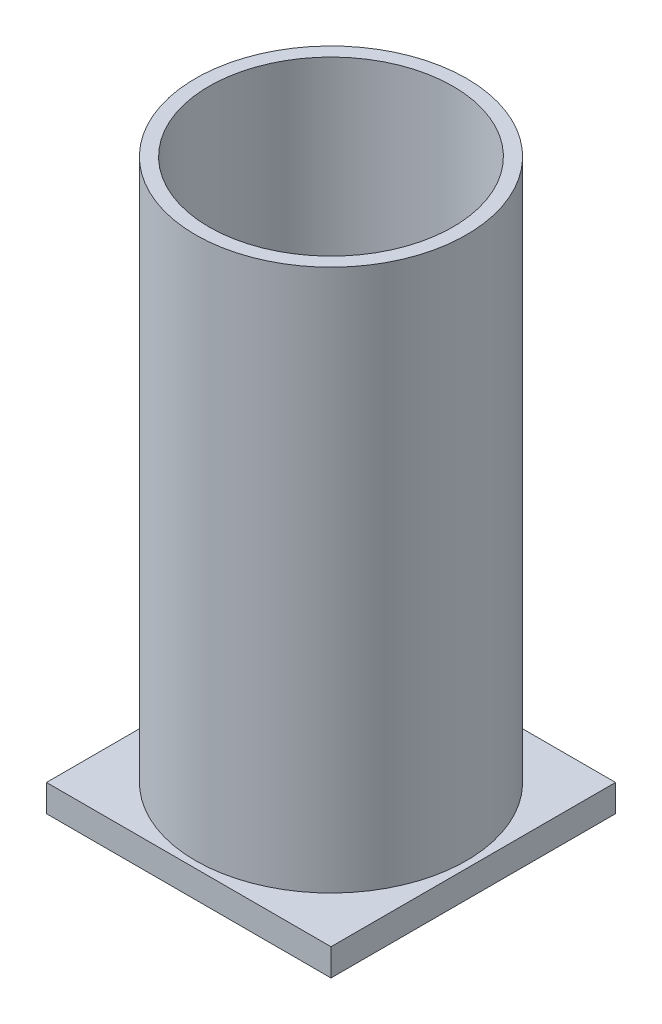
ISO-10303-21;
HEADER;
FILE_DESCRIPTION(('STEP AP214'),'2;1');
FILE_NAME('part.step','',(''),(''),'','','');
FILE_SCHEMA(('AUTOMOTIVE_DESIGN { 1 0 10303 214 1 1 1 1 }'));
ENDSEC;
DATA;
#1=APPLICATION_CONTEXT('core data for automotive mechanical design processes');
#2=APPLICATION_PROTOCOL_DEFINITION('international standard','automotive_design',2000,#1);
#3=PRODUCT_CONTEXT('',#1,'mechanical');
#4=PRODUCT('Part','Part','',(#3));
#5=PRODUCT_RELATED_PRODUCT_CATEGORY('part','',(#4));
#6=PRODUCT_DEFINITION_FORMATION('','',#4);
#7=PRODUCT_DEFINITION_CONTEXT('part definition',#1,'design');
#8=PRODUCT_DEFINITION('design','',#6,#7);
#9=PRODUCT_DEFINITION_SHAPE('','',#8);
#10=(LENGTH_UNIT() NAMED_UNIT(*) SI_UNIT(.MILLI.,.METRE.));
#11=(NAMED_UNIT(*) PLANE_ANGLE_UNIT() SI_UNIT($,.RADIAN.));
#12=(NAMED_UNIT(*) SI_UNIT($,.STERADIAN.) SOLID_ANGLE_UNIT());
#13=UNCERTAINTY_MEASURE_WITH_UNIT(LENGTH_MEASURE(1.E-05),#10,'distance_accuracy_value','');
#14=(GEOMETRIC_REPRESENTATION_CONTEXT(3) GLOBAL_UNCERTAINTY_ASSIGNED_CONTEXT((#13)) GLOBAL_UNIT_ASSIGNED_CONTEXT((#10,
#11,#12)) REPRESENTATION_CONTEXT('',''));
#15=CARTESIAN_POINT('',(0.,0.,0.));
#16=DIRECTION('',(0.,0.,1.));
#17=DIRECTION('',(1.,0.,0.));
#18=AXIS2_PLACEMENT_3D('',#15,#16,#17);
#19=CARTESIAN_POINT('',(0.,200.,0.));
#20=DIRECTION('',(0.,1.,0.));
#21=DIRECTION('',(0.,0.,1.));
#22=AXIS2_PLACEMENT_3D('',#19,#20,#21);
#23=PLANE('',#22);
#24=CARTESIAN_POINT('',(0.,200.,0.));
#25=DIRECTION('',(0.,1.,0.));
#26=DIRECTION('',(0.,0.,1.));
#27=AXIS2_PLACEMENT_3D('',#24,#25,#26);
#28=CIRCLE('',#27,50.);
#29=CARTESIAN_POINT('',(0.,200.,50.));
#30=VERTEX_POINT('',#29);
#31=EDGE_CURVE('E11',#30,#30,#28,.T.);
#32=ORIENTED_EDGE('',*,*,#31,.T.);
#33=EDGE_LOOP('',(#32));
#34=FACE_BOUND('',#33,.T.);
#35=CARTESIAN_POINT('',(0.,200.,0.));
#36=DIRECTION('',(0.,1.,0.));
#37=DIRECTION('',(0.,0.,1.));
#38=AXIS2_PLACEMENT_3D('',#35,#36,#37);
#39=CIRCLE('',#38,45.);
#40=CARTESIAN_POINT('',(0.,200.,45.));
#41=VERTEX_POINT('',#40);
#42=EDGE_CURVE('E43',#41,#41,#39,.T.);
#43=ORIENTED_EDGE('',*,*,#42,.F.);
#44=EDGE_LOOP('',(#43));
#45=FACE_BOUND('',#44,.T.);
#46=ADVANCED_FACE('F33',(#34,#45),#23,.T.);
#47=CARTESIAN_POINT('',(0.,200.,0.));
#48=DIRECTION('',(0.,-1.,0.));
#49=DIRECTION('',(0.,0.,-1.));
#50=AXIS2_PLACEMENT_3D('',#47,#48,#49);
#51=CYLINDRICAL_SURFACE('',#50,50.);
#52=ORIENTED_EDGE('',*,*,#31,.F.);
#53=EDGE_LOOP('',(#52));
#54=FACE_BOUND('',#53,.T.);
#55=CARTESIAN_POINT('',(0.,0.,0.));
#56=DIRECTION('',(0.,1.,0.));
#57=DIRECTION('',(0.,0.,1.));
#58=AXIS2_PLACEMENT_3D('',#55,#56,#57);
#59=CIRCLE('',#58,50.);
#60=CARTESIAN_POINT('',(0.,0.,50.));
#61=VERTEX_POINT('',#60);
#62=EDGE_CURVE('E37',#61,#61,#59,.T.);
#63=ORIENTED_EDGE('',*,*,#62,.T.);
#64=EDGE_LOOP('',(#63));
#65=FACE_BOUND('',#64,.T.);
#66=ADVANCED_FACE('F35',(#54,#65),#51,.T.);
#67=CARTESIAN_POINT('',(0.,200.,0.));
#68=DIRECTION('',(0.,-1.,0.));
#69=DIRECTION('',(0.,0.,-1.));
#70=AXIS2_PLACEMENT_3D('',#67,#68,#69);
#71=CYLINDRICAL_SURFACE('',#70,45.);
#72=ORIENTED_EDGE('',*,*,#42,.T.);
#73=EDGE_LOOP('',(#72));
#74=FACE_BOUND('',#73,.T.);
#75=CARTESIAN_POINT('',(0.,0.,0.));
#76=DIRECTION('',(0.,1.,0.));
#77=DIRECTION('',(0.,0.,1.));
#78=AXIS2_PLACEMENT_3D('',#75,#76,#77);
#79=CIRCLE('',#78,45.);
#80=CARTESIAN_POINT('',(0.,0.,45.));
#81=VERTEX_POINT('',#80);
#82=EDGE_CURVE('E115',#81,#81,#79,.T.);
#83=ORIENTED_EDGE('',*,*,#82,.F.);
#84=EDGE_LOOP('',(#83));
#85=FACE_BOUND('',#84,.T.);
#86=ADVANCED_FACE('F143',(#74,#85),#71,.F.);
#87=CARTESIAN_POINT('',(0.,0.,0.));
#88=DIRECTION('',(0.,1.,0.));
#89=DIRECTION('',(0.,0.,1.));
#90=AXIS2_PLACEMENT_3D('',#87,#88,#89);
#91=PLANE('',#90);
#92=ORIENTED_EDGE('',*,*,#82,.T.);
#93=EDGE_LOOP('',(#92));
#94=FACE_BOUND('',#93,.T.);
#95=ADVANCED_FACE('F127',(#94),#91,.T.);
#96=CARTESIAN_POINT('',(52.5,-10.,-52.5));
#97=DIRECTION('',(1.,0.,0.));
#98=DIRECTION('',(0.,0.,-1.));
#99=AXIS2_PLACEMENT_3D('',#96,#97,#98);
#100=PLANE('',#99);
#101=DIRECTION('',(0.,0.,-1.));
#102=VECTOR('',#101,1.);
#103=CARTESIAN_POINT('',(52.5,0.,-52.5));
#104=LINE('',#103,#102);
#105=CARTESIAN_POINT('',(52.5,0.,52.5));
#106=VERTEX_POINT('',#105);
#107=CARTESIAN_POINT('',(52.5,0.,-52.5));
#108=VERTEX_POINT('',#107);
#109=EDGE_CURVE('E102',#106,#108,#104,.T.);
#110=ORIENTED_EDGE('',*,*,#109,.F.);
#111=DIRECTION('',(0.,1.,0.));
#112=VECTOR('',#111,1.);
#113=CARTESIAN_POINT('',(52.5,-10.,52.5));
#114=LINE('',#113,#112);
#115=CARTESIAN_POINT('',(52.5,-10.,52.5));
#116=VERTEX_POINT('',#115);
#117=EDGE_CURVE('E51',#116,#106,#114,.T.);
#118=ORIENTED_EDGE('',*,*,#117,.F.);
#119=DIRECTION('',(0.,0.,-1.));
#120=VECTOR('',#119,1.);
#121=CARTESIAN_POINT('',(52.5,-10.,-52.5));
#122=LINE('',#121,#120);
#123=CARTESIAN_POINT('',(52.5,-10.,-52.5));
#124=VERTEX_POINT('',#123);
#125=EDGE_CURVE('E96',#116,#124,#122,.T.);
#126=ORIENTED_EDGE('',*,*,#125,.T.);
#127=DIRECTION('',(0.,1.,0.));
#128=VECTOR('',#127,1.);
#129=CARTESIAN_POINT('',(52.5,-10.,-52.5));
#130=LINE('',#129,#128);
#131=EDGE_CURVE('E79',#124,#108,#130,.T.);
#132=ORIENTED_EDGE('',*,*,#131,.T.);
#133=EDGE_LOOP('',(#110,#118,#126,#132));
#134=FACE_BOUND('',#133,.T.);
#135=ADVANCED_FACE('F128',(#134),#100,.T.);
#136=CARTESIAN_POINT('',(-52.5,-10.,52.5));
#137=DIRECTION('',(0.,0.,1.));
#138=DIRECTION('',(1.,0.,0.));
#139=AXIS2_PLACEMENT_3D('',#136,#137,#138);
#140=PLANE('',#139);
#141=DIRECTION('',(1.,0.,0.));
#142=VECTOR('',#141,1.);
#143=CARTESIAN_POINT('',(-52.5,0.,52.5));
#144=LINE('',#143,#142);
#145=CARTESIAN_POINT('',(-52.5,0.,52.5));
#146=VERTEX_POINT('',#145);
#147=EDGE_CURVE('E98',#146,#106,#144,.T.);
#148=ORIENTED_EDGE('',*,*,#147,.F.);
#149=DIRECTION('',(0.,1.,0.));
#150=VECTOR('',#149,1.);
#151=CARTESIAN_POINT('',(-52.5,-10.,52.5));
#152=LINE('',#151,#150);
#153=CARTESIAN_POINT('',(-52.5,-10.,52.5));
#154=VERTEX_POINT('',#153);
#155=EDGE_CURVE('E68',#154,#146,#152,.T.);
#156=ORIENTED_EDGE('',*,*,#155,.F.);
#157=DIRECTION('',(1.,0.,0.));
#158=VECTOR('',#157,1.);
#159=CARTESIAN_POINT('',(-52.5,-10.,52.5));
#160=LINE('',#159,#158);
#161=EDGE_CURVE('E93',#154,#116,#160,.T.);
#162=ORIENTED_EDGE('',*,*,#161,.T.);
#163=ORIENTED_EDGE('',*,*,#117,.T.);
#164=EDGE_LOOP('',(#148,#156,#162,#163));
#165=FACE_BOUND('',#164,.T.);
#166=ADVANCED_FACE('F129',(#165),#140,.T.);
#167=CARTESIAN_POINT('',(-52.5,-10.,-52.5));
#168=DIRECTION('',(-1.,0.,0.));
#169=DIRECTION('',(0.,0.,1.));
#170=AXIS2_PLACEMENT_3D('',#167,#168,#169);
#171=PLANE('',#170);
#172=DIRECTION('',(0.,0.,1.));
#173=VECTOR('',#172,1.);
#174=CARTESIAN_POINT('',(-52.5,0.,-52.5));
#175=LINE('',#174,#173);
#176=CARTESIAN_POINT('',(-52.5,0.,-52.5));
#177=VERTEX_POINT('',#176);
#178=EDGE_CURVE('E87',#177,#146,#175,.T.);
#179=ORIENTED_EDGE('',*,*,#178,.F.);
#180=DIRECTION('',(0.,1.,0.));
#181=VECTOR('',#180,1.);
#182=CARTESIAN_POINT('',(-52.5,-10.,-52.5));
#183=LINE('',#182,#181);
#184=CARTESIAN_POINT('',(-52.5,-10.,-52.5));
#185=VERTEX_POINT('',#184);
#186=EDGE_CURVE('E82',#185,#177,#183,.T.);
#187=ORIENTED_EDGE('',*,*,#186,.F.);
#188=DIRECTION('',(0.,0.,1.));
#189=VECTOR('',#188,1.);
#190=CARTESIAN_POINT('',(-52.5,-10.,-52.5));
#191=LINE('',#190,#189);
#192=EDGE_CURVE('E85',#185,#154,#191,.T.);
#193=ORIENTED_EDGE('',*,*,#192,.T.);
#194=ORIENTED_EDGE('',*,*,#155,.T.);
#195=EDGE_LOOP('',(#179,#187,#193,#194));
#196=FACE_BOUND('',#195,.T.);
#197=ADVANCED_FACE('F84',(#196),#171,.T.);
#198=CARTESIAN_POINT('',(-52.5,-10.,-52.5));
#199=DIRECTION('',(0.,0.,-1.));
#200=DIRECTION('',(-1.,0.,0.));
#201=AXIS2_PLACEMENT_3D('',#198,#199,#200);
#202=PLANE('',#201);
#203=DIRECTION('',(-1.,0.,0.));
#204=VECTOR('',#203,1.);
#205=CARTESIAN_POINT('',(-52.5,0.,-52.5));
#206=LINE('',#205,#204);
#207=EDGE_CURVE('E105',#108,#177,#206,.T.);
#208=ORIENTED_EDGE('',*,*,#207,.F.);
#209=ORIENTED_EDGE('',*,*,#131,.F.);
#210=DIRECTION('',(-1.,0.,0.));
#211=VECTOR('',#210,1.);
#212=CARTESIAN_POINT('',(-52.5,-10.,-52.5));
#213=LINE('',#212,#211);
#214=EDGE_CURVE('E92',#124,#185,#213,.T.);
#215=ORIENTED_EDGE('',*,*,#214,.T.);
#216=ORIENTED_EDGE('',*,*,#186,.T.);
#217=EDGE_LOOP('',(#208,#209,#215,#216));
#218=FACE_BOUND('',#217,.T.);
#219=ADVANCED_FACE('F95',(#218),#202,.T.);
#220=CARTESIAN_POINT('',(0.,-10.,0.));
#221=DIRECTION('',(0.,1.,0.));
#222=DIRECTION('',(0.,0.,1.));
#223=AXIS2_PLACEMENT_3D('',#220,#221,#222);
#224=PLANE('',#223);
#225=ORIENTED_EDGE('',*,*,#125,.F.);
#226=ORIENTED_EDGE('',*,*,#161,.F.);
#227=ORIENTED_EDGE('',*,*,#192,.F.);
#228=ORIENTED_EDGE('',*,*,#214,.F.);
#229=EDGE_LOOP('',(#225,#226,#227,#228));
#230=FACE_BOUND('',#229,.T.);
#231=ADVANCED_FACE('F91',(#230),#224,.F.);
#232=ORIENTED_EDGE('',*,*,#62,.F.);
#233=EDGE_LOOP('',(#232));
#234=FACE_BOUND('',#233,.T.);
#235=ORIENTED_EDGE('',*,*,#109,.T.);
#236=ORIENTED_EDGE('',*,*,#207,.T.);
#237=ORIENTED_EDGE('',*,*,#178,.T.);
#238=ORIENTED_EDGE('',*,*,#147,.T.);
#239=EDGE_LOOP('',(#235,#236,#237,#238));
#240=FACE_BOUND('',#239,.T.);
#241=ADVANCED_FACE('F123',(#234,#240),#91,.T.);
#242=CLOSED_SHELL('',(#46,#66,#86,#95,#135,#166,#197,#219,#231,#241));
#243=MANIFOLD_SOLID_BREP('B2',#242);
#244=ADVANCED_BREP_SHAPE_REPRESENTATION('',(#18,#243),#14);
#245=SHAPE_DEFINITION_REPRESENTATION(#9,#244);
ENDSEC;
END-ISO-10303-21;
